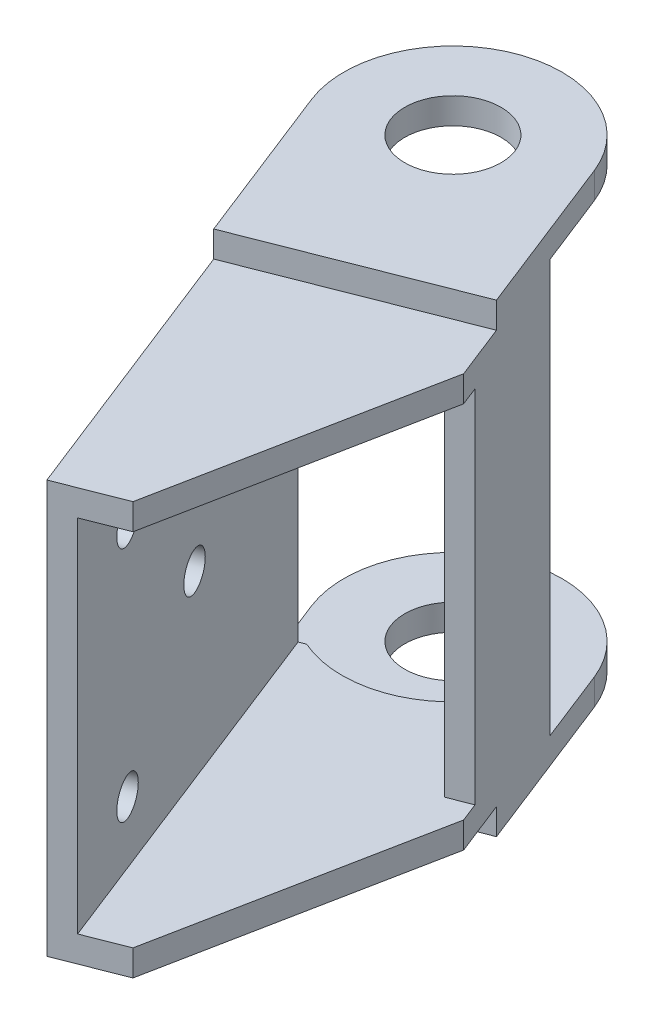
ISO-10303-21;
HEADER;
FILE_DESCRIPTION(('STEP AP214'),'2;1');
FILE_NAME('part.step','',(''),(''),'','','');
FILE_SCHEMA(('AUTOMOTIVE_DESIGN { 1 0 10303 214 1 1 1 1 }'));
ENDSEC;
DATA;
#1=APPLICATION_CONTEXT('core data for automotive mechanical design processes');
#2=APPLICATION_PROTOCOL_DEFINITION('international standard','automotive_design',2000,#1);
#3=PRODUCT_CONTEXT('',#1,'mechanical');
#4=PRODUCT('Part','Part','',(#3));
#5=PRODUCT_RELATED_PRODUCT_CATEGORY('part','',(#4));
#6=PRODUCT_DEFINITION_FORMATION('','',#4);
#7=PRODUCT_DEFINITION_CONTEXT('part definition',#1,'design');
#8=PRODUCT_DEFINITION('design','',#6,#7);
#9=PRODUCT_DEFINITION_SHAPE('','',#8);
#10=(LENGTH_UNIT() NAMED_UNIT(*) SI_UNIT(.MILLI.,.METRE.));
#11=(NAMED_UNIT(*) PLANE_ANGLE_UNIT() SI_UNIT($,.RADIAN.));
#12=(NAMED_UNIT(*) SI_UNIT($,.STERADIAN.) SOLID_ANGLE_UNIT());
#13=UNCERTAINTY_MEASURE_WITH_UNIT(LENGTH_MEASURE(1.E-05),#10,'distance_accuracy_value','');
#14=(GEOMETRIC_REPRESENTATION_CONTEXT(3) GLOBAL_UNCERTAINTY_ASSIGNED_CONTEXT((#13)) GLOBAL_UNIT_ASSIGNED_CONTEXT((#10,
#11,#12)) REPRESENTATION_CONTEXT('',''));
#15=CARTESIAN_POINT('',(0.,0.,0.));
#16=DIRECTION('',(0.,0.,1.));
#17=DIRECTION('',(1.,0.,0.));
#18=AXIS2_PLACEMENT_3D('',#15,#16,#17);
#19=CARTESIAN_POINT('',(-160.72838452882,-5.5,51.9386173243801));
#20=DIRECTION('',(0.,1.,0.));
#21=DIRECTION('',(0.,0.,1.));
#22=AXIS2_PLACEMENT_3D('',#19,#20,#21);
#23=PLANE('',#22);
#24=DIRECTION('',(0.365652358002226,0.,0.930751499105648));
#25=VECTOR('',#24,1.);
#26=CARTESIAN_POINT('',(-150.024742289129,-5.5,47.7336152073636));
#27=LINE('',#26,#25);
#28=CARTESIAN_POINT('',(-161.177139208116,-5.5,19.3456944848454));
#29=VERTEX_POINT('',#28);
#30=CARTESIAN_POINT('',(-154.503983674491,-5.5,36.3319093437392));
#31=VERTEX_POINT('',#30);
#32=EDGE_CURVE('E309',#29,#31,#27,.T.);
#33=ORIENTED_EDGE('',*,*,#32,.T.);
#34=DIRECTION('',(-0.930751499105649,0.,0.365652358002226));
#35=VECTOR('',#34,1.);
#36=CARTESIAN_POINT('',(-165.207625914183,-5.5,40.5369114607557));
#37=LINE('',#36,#35);
#38=CARTESIAN_POINT('',(-175.911268153856,-5.5,44.7419135777648));
#39=VERTEX_POINT('',#38);
#40=EDGE_CURVE('E55',#31,#39,#37,.T.);
#41=ORIENTED_EDGE('',*,*,#40,.T.);
#42=DIRECTION('',(-0.365652358000698,0.,-0.930751499106249));
#43=VECTOR('',#42,1.);
#44=CARTESIAN_POINT('',(-182.58442368746,-5.5,27.7556987188424));
#45=LINE('',#44,#43);
#46=CARTESIAN_POINT('',(-182.58442368746,-5.5,27.7556987188424));
#47=VERTEX_POINT('',#46);
#48=EDGE_CURVE('E304',#39,#47,#45,.T.);
#49=ORIENTED_EDGE('',*,*,#48,.T.);
#50=CARTESIAN_POINT('',(-171.880781447785,-5.5,23.5506966018527));
#51=DIRECTION('',(0.,-1.,0.));
#52=DIRECTION('',(0.,0.,1.));
#53=AXIS2_PLACEMENT_3D('',#50,#51,#52);
#54=CIRCLE('',#53,11.49999999995);
#55=EDGE_CURVE('E306',#47,#29,#54,.T.);
#56=ORIENTED_EDGE('',*,*,#55,.T.);
#57=EDGE_LOOP('',(#33,#41,#49,#56));
#58=FACE_BOUND('',#57,.T.);
#59=CARTESIAN_POINT('',(-171.8807814485,-5.5,23.5506966021));
#60=DIRECTION('',(0.,-1.,0.));
#61=DIRECTION('',(0.,0.,-1.));
#62=AXIS2_PLACEMENT_3D('',#59,#60,#61);
#63=CIRCLE('',#62,5.07500000000002);
#64=CARTESIAN_POINT('',(-171.8807814485,-5.5,18.4756966021));
#65=VERTEX_POINT('',#64);
#66=EDGE_CURVE('E266',#65,#65,#63,.T.);
#67=ORIENTED_EDGE('',*,*,#66,.F.);
#68=EDGE_LOOP('',(#67));
#69=FACE_BOUND('',#68,.T.);
#70=ADVANCED_FACE('F47',(#58,#69),#23,.F.);
#71=CARTESIAN_POINT('',(-11.9490681605092,0.,-30.4158112478024));
#72=DIRECTION('',(-0.365652358002225,0.,-0.930751499105649));
#73=DIRECTION('',(-0.930751499105649,0.,0.365652358002225));
#74=AXIS2_PLACEMENT_3D('',#71,#72,#73);
#75=PLANE('',#74);
#76=DIRECTION('',(0.,1.,0.));
#77=VECTOR('',#76,1.);
#78=CARTESIAN_POINT('',(-176.585881805809,-2.75,34.2629340254768));
#79=LINE('',#78,#77);
#80=CARTESIAN_POINT('',(-176.585881805809,-2.75,34.2629340254768));
#81=VERTEX_POINT('',#80);
#82=CARTESIAN_POINT('',(-176.585881805809,0.,34.2629340254768));
#83=VERTEX_POINT('',#82);
#84=EDGE_CURVE('E299',#81,#83,#79,.T.);
#85=ORIENTED_EDGE('',*,*,#84,.F.);
#86=DIRECTION('',(-0.930751499105649,0.,0.365652358002225));
#87=VECTOR('',#86,1.);
#88=CARTESIAN_POINT('',(-158.160507254501,-2.75,27.0243943527135));
#89=LINE('',#88,#87);
#90=CARTESIAN_POINT('',(-179.567791733931,-2.75,35.4343985867648));
#91=VERTEX_POINT('',#90);
#92=EDGE_CURVE('E369',#81,#91,#89,.T.);
#93=ORIENTED_EDGE('',*,*,#92,.T.);
#94=DIRECTION('',(0.,1.,0.));
#95=VECTOR('',#94,1.);
#96=CARTESIAN_POINT('',(-179.567791733931,-2.75,35.4343985867648));
#97=LINE('',#96,#95);
#98=CARTESIAN_POINT('',(-179.567791733931,40.75,35.4343985867648));
#99=VERTEX_POINT('',#98);
#100=EDGE_CURVE('E375',#91,#99,#97,.T.);
#101=ORIENTED_EDGE('',*,*,#100,.T.);
#102=DIRECTION('',(0.930751499105649,0.,-0.365652358002225));
#103=VECTOR('',#102,1.);
#104=CARTESIAN_POINT('',(-179.567791733931,40.75,35.4343985867648));
#105=LINE('',#104,#103);
#106=CARTESIAN_POINT('',(-176.585881805809,40.75,34.2629340254766));
#107=VERTEX_POINT('',#106);
#108=EDGE_CURVE('E379',#99,#107,#105,.T.);
#109=ORIENTED_EDGE('',*,*,#108,.T.);
#110=DIRECTION('',(0.,1.,0.));
#111=VECTOR('',#110,1.);
#112=CARTESIAN_POINT('',(-176.585881805809,38.,34.2629340254768));
#113=LINE('',#112,#111);
#114=CARTESIAN_POINT('',(-176.585881805809,38.0000000000003,34.2629340254769));
#115=VERTEX_POINT('',#114);
#116=EDGE_CURVE('E366',#115,#107,#113,.T.);
#117=ORIENTED_EDGE('',*,*,#116,.F.);
#118=DIRECTION('',(0.930751499105649,0.,-0.365652358002225));
#119=VECTOR('',#118,1.);
#120=CARTESIAN_POINT('',(-177.240912986167,38.0000000000003,34.5202676917593));
#121=LINE('',#120,#119);
#122=CARTESIAN_POINT('',(-177.240912986167,38.0000000000003,34.5202676917593));
#123=VERTEX_POINT('',#122);
#124=EDGE_CURVE('E340',#123,#115,#121,.T.);
#125=ORIENTED_EDGE('',*,*,#124,.F.);
#126=DIRECTION('',(0.,1.,0.));
#127=VECTOR('',#126,1.);
#128=CARTESIAN_POINT('',(-177.240912986166,2.74925928360182E-13,34.5202676917592));
#129=LINE('',#128,#127);
#130=CARTESIAN_POINT('',(-177.240912986166,2.74925928360182E-13,34.5202676917592));
#131=VERTEX_POINT('',#130);
#132=EDGE_CURVE('E337',#131,#123,#129,.T.);
#133=ORIENTED_EDGE('',*,*,#132,.F.);
#134=DIRECTION('',(0.930751499105649,0.,-0.365652358002226));
#135=VECTOR('',#134,1.);
#136=CARTESIAN_POINT('',(-176.585881805809,0.,34.2629340254767));
#137=LINE('',#136,#135);
#138=EDGE_CURVE('E357',#131,#83,#137,.T.);
#139=ORIENTED_EDGE('',*,*,#138,.T.);
#140=EDGE_LOOP('',(#85,#93,#101,#109,#117,#125,#133,#139));
#141=FACE_BOUND('',#140,.T.);
#142=ADVANCED_FACE('F444',(#141),#75,.T.);
#143=CARTESIAN_POINT('',(-6.82993515371631,0.,-17.3852902704244));
#144=DIRECTION('',(0.365652358061123,0.,0.93075149908251));
#145=DIRECTION('',(0.93075149908251,0.,-0.365652358061123));
#146=AXIS2_PLACEMENT_3D('',#143,#144,#145);
#147=PLANE('',#146);
#148=DIRECTION('',(-0.93075149908251,0.,0.365652358061123));
#149=VECTOR('',#148,1.);
#150=CARTESIAN_POINT('',(-153.041374243652,38.,40.0549153391781));
#151=LINE('',#150,#149);
#152=CARTESIAN_POINT('',(-153.041374243652,38.,40.0549153391781));
#153=VERTEX_POINT('',#152);
#154=CARTESIAN_POINT('',(-155.368252990242,38.0000000000002,40.9690462351789));
#155=VERTEX_POINT('',#154);
#156=EDGE_CURVE('E345',#153,#155,#151,.T.);
#157=ORIENTED_EDGE('',*,*,#156,.T.);
#158=DIRECTION('',(0.,1.,0.));
#159=VECTOR('',#158,1.);
#160=CARTESIAN_POINT('',(-155.368252990242,2.51062781034005E-13,40.9690462351788));
#161=LINE('',#160,#159);
#162=CARTESIAN_POINT('',(-155.36825299068,0.,40.9690462340644));
#163=VERTEX_POINT('',#162);
#164=EDGE_CURVE('E331',#163,#155,#161,.T.);
#165=ORIENTED_EDGE('',*,*,#164,.F.);
#166=DIRECTION('',(0.93075149908251,0.,-0.365652358061123));
#167=VECTOR('',#166,1.);
#168=CARTESIAN_POINT('',(-156.023284171507,0.,41.2263799005793));
#169=LINE('',#168,#167);
#170=CARTESIAN_POINT('',(-153.041374243652,0.,40.0549153391781));
#171=VERTEX_POINT('',#170);
#172=EDGE_CURVE('E348',#163,#171,#169,.T.);
#173=ORIENTED_EDGE('',*,*,#172,.T.);
#174=DIRECTION('',(0.,1.,0.));
#175=VECTOR('',#174,1.);
#176=CARTESIAN_POINT('',(-153.041374243652,0.,40.0549153391781));
#177=LINE('',#176,#175);
#178=EDGE_CURVE('E342',#171,#153,#177,.T.);
#179=ORIENTED_EDGE('',*,*,#178,.T.);
#180=EDGE_LOOP('',(#157,#165,#173,#179));
#181=FACE_BOUND('',#180,.T.);
#182=ADVANCED_FACE('F474',(#181),#147,.T.);
#183=DIRECTION('',(0.,1.,0.));
#184=VECTOR('',#183,1.);
#185=CARTESIAN_POINT('',(-161.142417182623,-2.75,28.1958589140017));
#186=LINE('',#185,#184);
#187=CARTESIAN_POINT('',(-161.142417182623,-2.75,28.1958589140016));
#188=VERTEX_POINT('',#187);
#189=CARTESIAN_POINT('',(-161.142417182623,0.,28.1958589140017));
#190=VERTEX_POINT('',#189);
#191=EDGE_CURVE('E297',#188,#190,#186,.T.);
#192=ORIENTED_EDGE('',*,*,#191,.T.);
#193=CARTESIAN_POINT('',(-160.487386002265,2.51062781034004E-13,27.9385252477194));
#194=VERTEX_POINT('',#193);
#195=EDGE_CURVE('E354',#190,#194,#137,.T.);
#196=ORIENTED_EDGE('',*,*,#195,.T.);
#197=DIRECTION('',(0.,-1.,0.));
#198=VECTOR('',#197,1.);
#199=CARTESIAN_POINT('',(-160.487386002265,38.0000000000002,27.9385252477194));
#200=LINE('',#199,#198);
#201=CARTESIAN_POINT('',(-160.487386002265,38.0000000000002,27.9385252477194));
#202=VERTEX_POINT('',#201);
#203=EDGE_CURVE('E326',#202,#194,#200,.T.);
#204=ORIENTED_EDGE('',*,*,#203,.F.);
#205=DIRECTION('',(-0.930751499105649,0.,0.365652358002225));
#206=VECTOR('',#205,1.);
#207=CARTESIAN_POINT('',(-160.487386002265,38.0000000000002,27.9385252477194));
#208=LINE('',#207,#206);
#209=CARTESIAN_POINT('',(-161.142417182623,38.0000000000002,28.1958589140019));
#210=VERTEX_POINT('',#209);
#211=EDGE_CURVE('E334',#202,#210,#208,.T.);
#212=ORIENTED_EDGE('',*,*,#211,.T.);
#213=DIRECTION('',(0.,1.,0.));
#214=VECTOR('',#213,1.);
#215=CARTESIAN_POINT('',(-161.142417182623,38.,28.1958589140015));
#216=LINE('',#215,#214);
#217=CARTESIAN_POINT('',(-161.142417182623,40.75,28.1958589140015));
#218=VERTEX_POINT('',#217);
#219=EDGE_CURVE('E364',#210,#218,#216,.T.);
#220=ORIENTED_EDGE('',*,*,#219,.T.);
#221=CARTESIAN_POINT('',(-158.160507254501,40.75,27.0243943527135));
#222=VERTEX_POINT('',#221);
#223=EDGE_CURVE('E378',#218,#222,#105,.T.);
#224=ORIENTED_EDGE('',*,*,#223,.T.);
#225=DIRECTION('',(0.,-1.,0.));
#226=VECTOR('',#225,1.);
#227=CARTESIAN_POINT('',(-158.160507254501,40.75,27.0243943527135));
#228=LINE('',#227,#226);
#229=CARTESIAN_POINT('',(-158.160507254501,-2.75,27.0243943527136));
#230=VERTEX_POINT('',#229);
#231=EDGE_CURVE('E382',#222,#230,#228,.T.);
#232=ORIENTED_EDGE('',*,*,#231,.T.);
#233=EDGE_CURVE('E372',#230,#188,#89,.T.);
#234=ORIENTED_EDGE('',*,*,#233,.T.);
#235=EDGE_LOOP('',(#192,#196,#204,#212,#220,#224,#232,#234));
#236=FACE_BOUND('',#235,.T.);
#237=ADVANCED_FACE('F454',(#236),#75,.T.);
#238=CARTESIAN_POINT('',(-164.933386645826,38.,41.234975084785));
#239=DIRECTION('',(0.,1.,0.));
#240=DIRECTION('',(1.,0.,0.));
#241=AXIS2_PLACEMENT_3D('',#238,#239,#240);
#242=PLANE('',#241);
#243=DIRECTION('',(-0.930751499105649,0.,0.365652358002225));
#244=VECTOR('',#243,1.);
#245=CARTESIAN_POINT('',(-164.530338511181,38.,73.7115539872527));
#246=LINE('',#245,#244);
#247=CARTESIAN_POINT('',(-158.015078017441,38.,71.1519874812371));
#248=VERTEX_POINT('',#247);
#249=CARTESIAN_POINT('',(-162.203459763416,38.,72.797423092247));
#250=VERTEX_POINT('',#249);
#251=EDGE_CURVE('E218',#248,#250,#246,.T.);
#252=ORIENTED_EDGE('',*,*,#251,.T.);
#253=DIRECTION('',(0.365652358002226,0.,0.930751499105649));
#254=VECTOR('',#253,1.);
#255=CARTESIAN_POINT('',(-177.240912986167,38.0000000000003,34.5202676917593));
#256=LINE('',#255,#254);
#257=EDGE_CURVE('E70',#123,#250,#256,.T.);
#258=ORIENTED_EDGE('',*,*,#257,.F.);
#259=ORIENTED_EDGE('',*,*,#124,.T.);
#260=CARTESIAN_POINT('',(-171.880781447868,38.,23.5506966017777));
#261=DIRECTION('',(0.,1.,0.));
#262=DIRECTION('',(0.,0.,1.));
#263=AXIS2_PLACEMENT_3D('',#260,#261,#262);
#264=CIRCLE('',#263,11.6999999999998);
#265=EDGE_CURVE('E361',#115,#210,#264,.T.);
#266=ORIENTED_EDGE('',*,*,#265,.T.);
#267=ORIENTED_EDGE('',*,*,#211,.F.);
#268=DIRECTION('',(-0.365652358002224,0.,-0.930751499105649));
#269=VECTOR('',#268,1.);
#270=CARTESIAN_POINT('',(-155.368252990242,38.0000000000002,40.9690462351789));
#271=LINE('',#270,#269);
#272=EDGE_CURVE('E323',#155,#202,#271,.T.);
#273=ORIENTED_EDGE('',*,*,#272,.F.);
#274=ORIENTED_EDGE('',*,*,#156,.F.);
#275=DIRECTION('',(0.365652358061124,0.,0.93075149908251));
#276=VECTOR('',#275,1.);
#277=CARTESIAN_POINT('',(-153.041374243652,38.,40.0549153391781));
#278=LINE('',#277,#276);
#279=CARTESIAN_POINT('',(-152.264362981806,38.,42.0327622755602));
#280=VERTEX_POINT('',#279);
#281=EDGE_CURVE('E350',#153,#280,#278,.T.);
#282=ORIENTED_EDGE('',*,*,#281,.T.);
#283=DIRECTION('',(-0.193746512314773,0.,0.981051624006536));
#284=VECTOR('',#283,1.);
#285=CARTESIAN_POINT('',(-158.015078017441,38.,71.1519874812371));
#286=LINE('',#285,#284);
#287=EDGE_CURVE('E240',#280,#248,#286,.T.);
#288=ORIENTED_EDGE('',*,*,#287,.T.);
#289=EDGE_LOOP('',(#252,#258,#259,#266,#267,#273,#274,#282,#288));
#290=FACE_BOUND('',#289,.T.);
#291=ADVANCED_FACE('F448',(#290),#242,.F.);
#292=CARTESIAN_POINT('',(-177.008225228049,-5.5,41.9496590801645));
#293=DIRECTION('',(-0.930751499105649,0.,0.365652358002226));
#294=DIRECTION('',(0.,1.,0.));
#295=AXIS2_PLACEMENT_3D('',#292,#293,#294);
#296=PLANE('',#295);
#297=CARTESIAN_POINT('',(-167.935476095037,6.5,65.0439306519319));
#298=DIRECTION('',(-0.930751499105649,0.,0.365652358002226));
#299=DIRECTION('',(0.365652358002226,0.,0.930751499105649));
#300=AXIS2_PLACEMENT_3D('',#297,#298,#299);
#301=CIRCLE('',#300,2.00000000000001);
#302=CARTESIAN_POINT('',(-167.204171379032,6.5,66.9054336501432));
#303=VERTEX_POINT('',#302);
#304=EDGE_CURVE('E860',#303,#303,#301,.T.);
#305=ORIENTED_EDGE('',*,*,#304,.F.);
#306=EDGE_LOOP('',(#305));
#307=FACE_BOUND('',#306,.T.);
#308=CARTESIAN_POINT('',(-167.935476095037,31.5,65.0439306519319));
#309=DIRECTION('',(-0.930751499105649,0.,0.365652358002226));
#310=DIRECTION('',(0.365652358002226,0.,0.930751499105649));
#311=AXIS2_PLACEMENT_3D('',#308,#309,#310);
#312=CIRCLE('',#311,2.00000000000001);
#313=CARTESIAN_POINT('',(-167.204171379032,31.5,66.9054336501432));
#314=VERTEX_POINT('',#313);
#315=EDGE_CURVE('E864',#314,#314,#312,.T.);
#316=ORIENTED_EDGE('',*,*,#315,.F.);
#317=EDGE_LOOP('',(#316));
#318=FACE_BOUND('',#317,.T.);
#319=CARTESIAN_POINT('',(-172.506130570065,19.,53.4095369131112));
#320=DIRECTION('',(-0.930751499105649,0.,0.365652358002226));
#321=DIRECTION('',(0.365652358002226,0.,0.930751499105649));
#322=AXIS2_PLACEMENT_3D('',#319,#320,#321);
#323=CIRCLE('',#322,2.00000000000001);
#324=CARTESIAN_POINT('',(-171.77482585406,19.,55.2710399113225));
#325=VERTEX_POINT('',#324);
#326=EDGE_CURVE('E867',#325,#325,#323,.T.);
#327=ORIENTED_EDGE('',*,*,#326,.F.);
#328=EDGE_LOOP('',(#327));
#329=FACE_BOUND('',#328,.T.);
#330=DIRECTION('',(0.,-1.,0.));
#331=VECTOR('',#330,1.);
#332=CARTESIAN_POINT('',(-164.530338511181,38.2337242901608,73.7115539872527));
#333=LINE('',#332,#331);
#334=CARTESIAN_POINT('',(-164.530338511181,40.75,73.7115539872527));
#335=VERTEX_POINT('',#334);
#336=CARTESIAN_POINT('',(-164.530338511181,-2.75,73.7115539872527));
#337=VERTEX_POINT('',#336);
#338=EDGE_CURVE('E250',#335,#337,#333,.T.);
#339=ORIENTED_EDGE('',*,*,#338,.F.);
#340=DIRECTION('',(0.365652358002226,0.,0.930751499105649));
#341=VECTOR('',#340,1.);
#342=CARTESIAN_POINT('',(-177.008225228049,40.75,41.9496590801645));
#343=LINE('',#342,#341);
#344=CARTESIAN_POINT('',(-175.911268153921,40.75,44.7419135777904));
#345=VERTEX_POINT('',#344);
#346=EDGE_CURVE('E233',#345,#335,#343,.T.);
#347=ORIENTED_EDGE('',*,*,#346,.F.);
#348=DIRECTION('',(0.,-1.,0.));
#349=VECTOR('',#348,1.);
#350=CARTESIAN_POINT('',(-175.911268153921,-5.5,44.7419135777904));
#351=LINE('',#350,#349);
#352=CARTESIAN_POINT('',(-175.911268153884,43.5,44.7419135777757));
#353=VERTEX_POINT('',#352);
#354=EDGE_CURVE('E279',#353,#345,#351,.T.);
#355=ORIENTED_EDGE('',*,*,#354,.F.);
#356=DIRECTION('',(0.365652357999172,0.,0.930751499106848));
#357=VECTOR('',#356,1.);
#358=CARTESIAN_POINT('',(-171.432026768565,43.5,56.1436194413973));
#359=LINE('',#358,#357);
#360=CARTESIAN_POINT('',(-182.584423687474,43.5,27.7556987188073));
#361=VERTEX_POINT('',#360);
#362=EDGE_CURVE('E394',#361,#353,#359,.T.);
#363=ORIENTED_EDGE('',*,*,#362,.F.);
#364=DIRECTION('',(0.,-1.,0.));
#365=VECTOR('',#364,1.);
#366=CARTESIAN_POINT('',(-182.584423687474,43.5,27.7556987188073));
#367=LINE('',#366,#365);
#368=CARTESIAN_POINT('',(-182.584423687583,40.75,27.7556987188033));
#369=VERTEX_POINT('',#368);
#370=EDGE_CURVE('E397',#361,#369,#367,.T.);
#371=ORIENTED_EDGE('',*,*,#370,.T.);
#372=DIRECTION('',(-0.365652358002225,0.,-0.930751499105649));
#373=VECTOR('',#372,1.);
#374=CARTESIAN_POINT('',(-179.567791733931,40.75,35.4343985867648));
#375=LINE('',#374,#373);
#376=EDGE_CURVE('E385',#99,#369,#375,.T.);
#377=ORIENTED_EDGE('',*,*,#376,.F.);
#378=ORIENTED_EDGE('',*,*,#100,.F.);
#379=DIRECTION('',(-0.365652358000698,0.,-0.930751499106249));
#380=VECTOR('',#379,1.);
#381=CARTESIAN_POINT('',(-182.58442368746,-2.75,27.7556987188424));
#382=LINE('',#381,#380);
#383=CARTESIAN_POINT('',(-182.58442368746,-2.75,27.7556987188424));
#384=VERTEX_POINT('',#383);
#385=EDGE_CURVE('E301',#91,#384,#382,.T.);
#386=ORIENTED_EDGE('',*,*,#385,.T.);
#387=DIRECTION('',(0.,1.,0.));
#388=VECTOR('',#387,1.);
#389=CARTESIAN_POINT('',(-182.58442368746,-5.5,27.7556987188424));
#390=LINE('',#389,#388);
#391=EDGE_CURVE('E320',#47,#384,#390,.T.);
#392=ORIENTED_EDGE('',*,*,#391,.F.);
#393=ORIENTED_EDGE('',*,*,#48,.F.);
#394=DIRECTION('',(0.,-1.,0.));
#395=VECTOR('',#394,1.);
#396=CARTESIAN_POINT('',(-175.911268153921,-5.50000000000002,44.7419135777904));
#397=LINE('',#396,#395);
#398=CARTESIAN_POINT('',(-175.911268153921,-2.75,44.7419135777904));
#399=VERTEX_POINT('',#398);
#400=EDGE_CURVE('E290',#399,#39,#397,.T.);
#401=ORIENTED_EDGE('',*,*,#400,.F.);
#402=DIRECTION('',(-0.365652358002226,0.,-0.930751499105649));
#403=VECTOR('',#402,1.);
#404=CARTESIAN_POINT('',(-177.008225228049,-2.75,41.9496590801645));
#405=LINE('',#404,#403);
#406=EDGE_CURVE('E292',#337,#399,#405,.T.);
#407=ORIENTED_EDGE('',*,*,#406,.F.);
#408=EDGE_LOOP('',(#339,#347,#355,#363,#371,#377,#378,#386,#392,#393,#401,#407));
#409=FACE_BOUND('',#408,.T.);
#410=ADVANCED_FACE('F49',(#307,#318,#329,#409),#296,.T.);
#411=CARTESIAN_POINT('',(-155.600940748619,-5.5,33.5396548461134));
#412=DIRECTION('',(0.930751499105649,0.,-0.365652358002226));
#413=DIRECTION('',(0.,-1.,0.));
#414=AXIS2_PLACEMENT_3D('',#411,#412,#413);
#415=PLANE('',#414);
#416=DIRECTION('',(0.,-1.,0.));
#417=VECTOR('',#416,1.);
#418=CARTESIAN_POINT('',(-152.264362981806,82.9361499625184,42.0327622755602));
#419=LINE('',#418,#417);
#420=CARTESIAN_POINT('',(-152.264362981806,0.,42.0327622755602));
#421=VERTEX_POINT('',#420);
#422=CARTESIAN_POINT('',(-152.264362981806,-2.75,42.0327622755602));
#423=VERTEX_POINT('',#422);
#424=EDGE_CURVE('E257',#421,#423,#419,.T.);
#425=ORIENTED_EDGE('',*,*,#424,.T.);
#426=DIRECTION('',(0.365652358002225,0.,0.930751499105649));
#427=VECTOR('',#426,1.);
#428=CARTESIAN_POINT('',(-154.503983674491,-2.75,36.3319093437392));
#429=LINE('',#428,#427);
#430=CARTESIAN_POINT('',(-154.503983674491,-2.75,36.3319093437392));
#431=VERTEX_POINT('',#430);
#432=EDGE_CURVE('E285',#431,#423,#429,.T.);
#433=ORIENTED_EDGE('',*,*,#432,.F.);
#434=DIRECTION('',(0.,1.,0.));
#435=VECTOR('',#434,1.);
#436=CARTESIAN_POINT('',(-154.503983674491,-5.5,36.3319093437392));
#437=LINE('',#436,#435);
#438=EDGE_CURVE('E282',#31,#431,#437,.T.);
#439=ORIENTED_EDGE('',*,*,#438,.F.);
#440=ORIENTED_EDGE('',*,*,#32,.F.);
#441=DIRECTION('',(0.,1.,0.));
#442=VECTOR('',#441,1.);
#443=CARTESIAN_POINT('',(-161.177139208116,-5.5,19.3456944848454));
#444=LINE('',#443,#442);
#445=CARTESIAN_POINT('',(-161.177139208116,-2.75,19.3456944848454));
#446=VERTEX_POINT('',#445);
#447=EDGE_CURVE('E312',#29,#446,#444,.T.);
#448=ORIENTED_EDGE('',*,*,#447,.T.);
#449=DIRECTION('',(0.365652358002226,0.,0.930751499105648));
#450=VECTOR('',#449,1.);
#451=CARTESIAN_POINT('',(-150.024742289129,-2.75,47.7336152073636));
#452=LINE('',#451,#450);
#453=EDGE_CURVE('E307',#446,#230,#452,.T.);
#454=ORIENTED_EDGE('',*,*,#453,.T.);
#455=ORIENTED_EDGE('',*,*,#231,.F.);
#456=DIRECTION('',(-0.365652358002225,0.,-0.930751499105649));
#457=VECTOR('',#456,1.);
#458=CARTESIAN_POINT('',(-158.160507254501,40.75,27.0243943527135));
#459=LINE('',#458,#457);
#460=CARTESIAN_POINT('',(-161.177139208153,40.75,19.3456944847521));
#461=VERTEX_POINT('',#460);
#462=EDGE_CURVE('E386',#222,#461,#459,.T.);
#463=ORIENTED_EDGE('',*,*,#462,.T.);
#464=DIRECTION('',(0.,-1.,0.));
#465=VECTOR('',#464,1.);
#466=CARTESIAN_POINT('',(-161.177139208116,43.5,19.3456944848454));
#467=LINE('',#466,#465);
#468=CARTESIAN_POINT('',(-161.177139208116,43.5,19.3456944848454));
#469=VERTEX_POINT('',#468);
#470=EDGE_CURVE('E402',#469,#461,#467,.T.);
#471=ORIENTED_EDGE('',*,*,#470,.F.);
#472=DIRECTION('',(-0.3656523580007,0.,-0.930751499106248));
#473=VECTOR('',#472,1.);
#474=CARTESIAN_POINT('',(-161.177139208116,43.5,19.3456944848454));
#475=LINE('',#474,#473);
#476=CARTESIAN_POINT('',(-154.503983674519,43.5,36.3319093437501));
#477=VERTEX_POINT('',#476);
#478=EDGE_CURVE('E390',#477,#469,#475,.T.);
#479=ORIENTED_EDGE('',*,*,#478,.F.);
#480=DIRECTION('',(0.,1.,0.));
#481=VECTOR('',#480,1.);
#482=CARTESIAN_POINT('',(-154.503983674491,40.75,36.3319093437392));
#483=LINE('',#482,#481);
#484=CARTESIAN_POINT('',(-154.503983674491,40.75,36.3319093437392));
#485=VERTEX_POINT('',#484);
#486=EDGE_CURVE('E274',#485,#477,#483,.T.);
#487=ORIENTED_EDGE('',*,*,#486,.F.);
#488=DIRECTION('',(-0.365652358002225,0.,-0.930751499105649));
#489=VECTOR('',#488,1.);
#490=CARTESIAN_POINT('',(-150.024742289085,40.75,47.7336152074748));
#491=LINE('',#490,#489);
#492=CARTESIAN_POINT('',(-152.264362981806,40.75,42.0327622755602));
#493=VERTEX_POINT('',#492);
#494=EDGE_CURVE('E272',#493,#485,#491,.T.);
#495=ORIENTED_EDGE('',*,*,#494,.F.);
#496=EDGE_CURVE('E225',#493,#280,#419,.T.);
#497=ORIENTED_EDGE('',*,*,#496,.T.);
#498=ORIENTED_EDGE('',*,*,#281,.F.);
#499=ORIENTED_EDGE('',*,*,#178,.F.);
#500=DIRECTION('',(0.365652358061124,0.,0.93075149908251));
#501=VECTOR('',#500,1.);
#502=CARTESIAN_POINT('',(-153.041374243652,0.,40.0549153391781));
#503=LINE('',#502,#501);
#504=EDGE_CURVE('E351',#171,#421,#503,.T.);
#505=ORIENTED_EDGE('',*,*,#504,.T.);
#506=EDGE_LOOP('',(#425,#433,#439,#440,#448,#454,#455,#463,#471,#479,#487,#495,#497,#498,#499,#505));
#507=FACE_BOUND('',#506,.T.);
#508=ADVANCED_FACE('F423',(#507),#415,.T.);
#509=CARTESIAN_POINT('',(-160.72838452886,40.75,51.938617324416));
#510=DIRECTION('',(0.,-1.,0.));
#511=DIRECTION('',(0.,0.,-1.));
#512=AXIS2_PLACEMENT_3D('',#509,#510,#511);
#513=PLANE('',#512);
#514=CARTESIAN_POINT('',(-171.8807814485,40.75,23.5506966021));
#515=DIRECTION('',(0.,-1.,0.));
#516=DIRECTION('',(0.,0.,-1.));
#517=AXIS2_PLACEMENT_3D('',#514,#515,#516);
#518=CIRCLE('',#517,5.07500000000002);
#519=CARTESIAN_POINT('',(-171.8807814485,40.75,18.4756966021));
#520=VERTEX_POINT('',#519);
#521=EDGE_CURVE('E260',#520,#520,#518,.T.);
#522=ORIENTED_EDGE('',*,*,#521,.F.);
#523=EDGE_LOOP('',(#522));
#524=FACE_BOUND('',#523,.T.);
#525=CARTESIAN_POINT('',(-171.880781447792,40.75,23.5506966018351));
#526=DIRECTION('',(0.,1.,0.));
#527=DIRECTION('',(0.,0.,-1.));
#528=AXIS2_PLACEMENT_3D('',#525,#526,#527);
#529=CIRCLE('',#528,11.49999999995);
#530=EDGE_CURVE('E388',#461,#369,#529,.T.);
#531=ORIENTED_EDGE('',*,*,#530,.F.);
#532=ORIENTED_EDGE('',*,*,#462,.F.);
#533=ORIENTED_EDGE('',*,*,#223,.F.);
#534=CARTESIAN_POINT('',(-171.880781447868,40.75,23.5506966017777));
#535=DIRECTION('',(0.,1.,0.));
#536=DIRECTION('',(0.,0.,1.));
#537=AXIS2_PLACEMENT_3D('',#534,#535,#536);
#538=CIRCLE('',#537,11.6999999999998);
#539=EDGE_CURVE('E360',#107,#218,#538,.T.);
#540=ORIENTED_EDGE('',*,*,#539,.F.);
#541=ORIENTED_EDGE('',*,*,#108,.F.);
#542=ORIENTED_EDGE('',*,*,#376,.T.);
#543=EDGE_LOOP('',(#531,#532,#533,#540,#541,#542));
#544=FACE_BOUND('',#543,.T.);
#545=ADVANCED_FACE('F459',(#524,#544),#513,.T.);
#546=CARTESIAN_POINT('',(-171.880781447792,43.5,23.5506966018351));
#547=DIRECTION('',(0.,-1.,0.));
#548=DIRECTION('',(0.,0.,-1.));
#549=AXIS2_PLACEMENT_3D('',#546,#547,#548);
#550=CYLINDRICAL_SURFACE('',#549,11.49999999995);
#551=ORIENTED_EDGE('',*,*,#530,.T.);
#552=ORIENTED_EDGE('',*,*,#370,.F.);
#553=CARTESIAN_POINT('',(-171.880781447792,43.5,23.5506966018351));
#554=DIRECTION('',(0.,1.,0.));
#555=DIRECTION('',(0.,0.,-1.));
#556=AXIS2_PLACEMENT_3D('',#553,#554,#555);
#557=CIRCLE('',#556,11.49999999995);
#558=EDGE_CURVE('E392',#469,#361,#557,.T.);
#559=ORIENTED_EDGE('',*,*,#558,.F.);
#560=ORIENTED_EDGE('',*,*,#470,.T.);
#561=EDGE_LOOP('',(#551,#552,#559,#560));
#562=FACE_BOUND('',#561,.T.);
#563=ADVANCED_FACE('F486',(#562),#550,.T.);
#564=CARTESIAN_POINT('',(-160.72838452886,43.5,51.938617324416));
#565=DIRECTION('',(0.,-1.,0.));
#566=DIRECTION('',(0.,0.,-1.));
#567=AXIS2_PLACEMENT_3D('',#564,#565,#566);
#568=PLANE('',#567);
#569=CARTESIAN_POINT('',(-171.8807814485,43.5,23.5506966021));
#570=DIRECTION('',(0.,-1.,0.));
#571=DIRECTION('',(0.,0.,-1.));
#572=AXIS2_PLACEMENT_3D('',#569,#570,#571);
#573=CIRCLE('',#572,5.07500000000002);
#574=CARTESIAN_POINT('',(-171.8807814485,43.5,18.4756966021));
#575=VERTEX_POINT('',#574);
#576=EDGE_CURVE('E263',#575,#575,#573,.T.);
#577=ORIENTED_EDGE('',*,*,#576,.T.);
#578=EDGE_LOOP('',(#577));
#579=FACE_BOUND('',#578,.T.);
#580=ORIENTED_EDGE('',*,*,#362,.T.);
#581=DIRECTION('',(0.930751499105649,0.,-0.365652358002226));
#582=VECTOR('',#581,1.);
#583=CARTESIAN_POINT('',(-165.207625914229,43.5,40.5369114607739));
#584=LINE('',#583,#582);
#585=EDGE_CURVE('E12',#353,#477,#584,.T.);
#586=ORIENTED_EDGE('',*,*,#585,.T.);
#587=ORIENTED_EDGE('',*,*,#478,.T.);
#588=ORIENTED_EDGE('',*,*,#558,.T.);
#589=EDGE_LOOP('',(#580,#586,#587,#588));
#590=FACE_BOUND('',#589,.T.);
#591=ADVANCED_FACE('F482',(#579,#590),#568,.F.);
#592=CARTESIAN_POINT('',(-160.72838452886,0.,51.938617324416));
#593=DIRECTION('',(0.,1.,0.));
#594=DIRECTION('',(0.,0.,1.));
#595=AXIS2_PLACEMENT_3D('',#592,#593,#594);
#596=PLANE('',#595);
#597=DIRECTION('',(-0.365652358002224,0.,-0.930751499105649));
#598=VECTOR('',#597,1.);
#599=CARTESIAN_POINT('',(-172.121779974143,2.74925928360181E-13,47.550788679219));
#600=LINE('',#599,#598);
#601=CARTESIAN_POINT('',(-162.203459763416,0.,72.7974230922469));
#602=VERTEX_POINT('',#601);
#603=EDGE_CURVE('E62',#602,#131,#600,.T.);
#604=ORIENTED_EDGE('',*,*,#603,.F.);
#605=DIRECTION('',(-0.930751499105649,0.,0.365652358002225));
#606=VECTOR('',#605,1.);
#607=CARTESIAN_POINT('',(-164.530338511181,0.,73.7115539872527));
#608=LINE('',#607,#606);
#609=CARTESIAN_POINT('',(-158.015078017441,0.,71.1519874812371));
#610=VERTEX_POINT('',#609);
#611=EDGE_CURVE('E246',#610,#602,#608,.T.);
#612=ORIENTED_EDGE('',*,*,#611,.F.);
#613=DIRECTION('',(-0.193746512314773,0.,0.981051624006536));
#614=VECTOR('',#613,1.);
#615=CARTESIAN_POINT('',(-158.015078017441,0.,71.1519874812371));
#616=LINE('',#615,#614);
#617=EDGE_CURVE('E251',#421,#610,#616,.T.);
#618=ORIENTED_EDGE('',*,*,#617,.F.);
#619=ORIENTED_EDGE('',*,*,#504,.F.);
#620=ORIENTED_EDGE('',*,*,#172,.F.);
#621=DIRECTION('',(0.365652358002224,0.,0.930751499105649));
#622=VECTOR('',#621,1.);
#623=CARTESIAN_POINT('',(-160.487386002265,2.51062781034004E-13,27.9385252477194));
#624=LINE('',#623,#622);
#625=EDGE_CURVE('E329',#194,#163,#624,.T.);
#626=ORIENTED_EDGE('',*,*,#625,.F.);
#627=ORIENTED_EDGE('',*,*,#195,.F.);
#628=CARTESIAN_POINT('',(-171.880781447868,0.,23.5506966017777));
#629=DIRECTION('',(0.,1.,0.));
#630=DIRECTION('',(0.,0.,1.));
#631=AXIS2_PLACEMENT_3D('',#628,#629,#630);
#632=CIRCLE('',#631,11.6999999999999);
#633=EDGE_CURVE('E294',#83,#190,#632,.T.);
#634=ORIENTED_EDGE('',*,*,#633,.F.);
#635=ORIENTED_EDGE('',*,*,#138,.F.);
#636=EDGE_LOOP('',(#604,#612,#618,#619,#620,#626,#627,#634,#635));
#637=FACE_BOUND('',#636,.T.);
#638=ADVANCED_FACE('F437',(#637),#596,.T.);
#639=CARTESIAN_POINT('',(-171.880781447868,38.,23.5506966017777));
#640=DIRECTION('',(0.,1.,0.));
#641=DIRECTION('',(0.,0.,1.));
#642=AXIS2_PLACEMENT_3D('',#639,#640,#641);
#643=CYLINDRICAL_SURFACE('',#642,11.6999999999998);
#644=ORIENTED_EDGE('',*,*,#539,.T.);
#645=ORIENTED_EDGE('',*,*,#219,.F.);
#646=ORIENTED_EDGE('',*,*,#265,.F.);
#647=ORIENTED_EDGE('',*,*,#116,.T.);
#648=EDGE_LOOP('',(#644,#645,#646,#647));
#649=FACE_BOUND('',#648,.T.);
#650=ADVANCED_FACE('F451',(#649),#643,.F.);
#651=CARTESIAN_POINT('',(-165.291844825657,-2.88756986903428E-13,64.9360789395612));
#652=DIRECTION('',(0.930751499105649,0.,-0.365652358002224));
#653=DIRECTION('',(-0.365652358002224,0.,-0.930751499105649));
#654=AXIS2_PLACEMENT_3D('',#651,#652,#653);
#655=PLANE('',#654);
#656=CARTESIAN_POINT('',(-165.608597347272,6.5,64.1297997569261));
#657=DIRECTION('',(0.930751499105649,0.,-0.365652358002224));
#658=DIRECTION('',(-0.365652358002224,0.,-0.930751499105649));
#659=AXIS2_PLACEMENT_3D('',#656,#657,#658);
#660=CIRCLE('',#659,2.00000000000001);
#661=CARTESIAN_POINT('',(-166.339902063277,6.5,62.2682967587148));
#662=VERTEX_POINT('',#661);
#663=EDGE_CURVE('E236',#662,#662,#660,.F.);
#664=ORIENTED_EDGE('',*,*,#663,.T.);
#665=EDGE_LOOP('',(#664));
#666=FACE_BOUND('',#665,.T.);
#667=CARTESIAN_POINT('',(-165.608597347272,31.5,64.1297997569261));
#668=DIRECTION('',(0.930751499105649,0.,-0.365652358002224));
#669=DIRECTION('',(-0.365652358002224,0.,-0.930751499105649));
#670=AXIS2_PLACEMENT_3D('',#667,#668,#669);
#671=CIRCLE('',#670,2.00000000000001);
#672=CARTESIAN_POINT('',(-166.339902063277,31.5,62.2682967587148));
#673=VERTEX_POINT('',#672);
#674=EDGE_CURVE('E873',#673,#673,#671,.F.);
#675=ORIENTED_EDGE('',*,*,#674,.T.);
#676=EDGE_LOOP('',(#675));
#677=FACE_BOUND('',#676,.T.);
#678=CARTESIAN_POINT('',(-170.1792518223,19.,52.4954060181055));
#679=DIRECTION('',(0.930751499105649,0.,-0.365652358002224));
#680=DIRECTION('',(-0.365652358002224,0.,-0.930751499105649));
#681=AXIS2_PLACEMENT_3D('',#678,#679,#680);
#682=CIRCLE('',#681,2.00000000000001);
#683=CARTESIAN_POINT('',(-170.910556538305,19.,50.6339030198942));
#684=VERTEX_POINT('',#683);
#685=EDGE_CURVE('E868',#684,#684,#682,.F.);
#686=ORIENTED_EDGE('',*,*,#685,.T.);
#687=EDGE_LOOP('',(#686));
#688=FACE_BOUND('',#687,.T.);
#689=ORIENTED_EDGE('',*,*,#603,.T.);
#690=ORIENTED_EDGE('',*,*,#132,.T.);
#691=ORIENTED_EDGE('',*,*,#257,.T.);
#692=DIRECTION('',(0.,1.,0.));
#693=VECTOR('',#692,1.);
#694=CARTESIAN_POINT('',(-162.203459763416,0.,72.797423092247));
#695=LINE('',#694,#693);
#696=EDGE_CURVE('E234',#602,#250,#695,.T.);
#697=ORIENTED_EDGE('',*,*,#696,.F.);
#698=EDGE_LOOP('',(#689,#690,#691,#697));
#699=FACE_BOUND('',#698,.T.);
#700=ADVANCED_FACE('F439',(#666,#677,#688,#699),#655,.T.);
#701=CARTESIAN_POINT('',(-148.538317841756,-2.43690903303847E-13,58.3543364955213));
#702=DIRECTION('',(-0.930751499105649,0.,0.365652358002224));
#703=DIRECTION('',(0.365652358002224,0.,0.930751499105649));
#704=AXIS2_PLACEMENT_3D('',#701,#702,#703);
#705=PLANE('',#704);
#706=ORIENTED_EDGE('',*,*,#272,.T.);
#707=ORIENTED_EDGE('',*,*,#203,.T.);
#708=ORIENTED_EDGE('',*,*,#625,.T.);
#709=ORIENTED_EDGE('',*,*,#164,.T.);
#710=EDGE_LOOP('',(#706,#707,#708,#709));
#711=FACE_BOUND('',#710,.T.);
#712=ADVANCED_FACE('F471',(#711),#705,.T.);
#713=CARTESIAN_POINT('',(-160.72838452882,-2.75,51.9386173243801));
#714=DIRECTION('',(0.,1.,0.));
#715=DIRECTION('',(0.,0.,1.));
#716=AXIS2_PLACEMENT_3D('',#713,#714,#715);
#717=PLANE('',#716);
#718=CARTESIAN_POINT('',(-171.8807814485,-2.75,23.5506966021));
#719=DIRECTION('',(0.,1.,0.));
#720=DIRECTION('',(0.,0.,1.));
#721=AXIS2_PLACEMENT_3D('',#718,#719,#720);
#722=CIRCLE('',#721,5.07500000000002);
#723=CARTESIAN_POINT('',(-171.8807814485,-2.75,28.6256966021));
#724=VERTEX_POINT('',#723);
#725=EDGE_CURVE('E269',#724,#724,#722,.T.);
#726=ORIENTED_EDGE('',*,*,#725,.F.);
#727=EDGE_LOOP('',(#726));
#728=FACE_BOUND('',#727,.T.);
#729=ORIENTED_EDGE('',*,*,#233,.F.);
#730=ORIENTED_EDGE('',*,*,#453,.F.);
#731=CARTESIAN_POINT('',(-171.880781447785,-2.75,23.5506966018527));
#732=DIRECTION('',(0.,-1.,0.));
#733=DIRECTION('',(0.,0.,1.));
#734=AXIS2_PLACEMENT_3D('',#731,#732,#733);
#735=CIRCLE('',#734,11.49999999995);
#736=EDGE_CURVE('E314',#384,#446,#735,.T.);
#737=ORIENTED_EDGE('',*,*,#736,.F.);
#738=ORIENTED_EDGE('',*,*,#385,.F.);
#739=ORIENTED_EDGE('',*,*,#92,.F.);
#740=CARTESIAN_POINT('',(-171.880781447868,-2.75,23.5506966017777));
#741=DIRECTION('',(0.,1.,0.));
#742=DIRECTION('',(0.,0.,1.));
#743=AXIS2_PLACEMENT_3D('',#740,#741,#742);
#744=CIRCLE('',#743,11.6999999999999);
#745=EDGE_CURVE('E295',#81,#188,#744,.T.);
#746=ORIENTED_EDGE('',*,*,#745,.T.);
#747=EDGE_LOOP('',(#729,#730,#737,#738,#739,#746));
#748=FACE_BOUND('',#747,.T.);
#749=ADVANCED_FACE('F465',(#728,#748),#717,.T.);
#750=CARTESIAN_POINT('',(-171.880781447785,-5.5,23.5506966018527));
#751=DIRECTION('',(0.,1.,0.));
#752=DIRECTION('',(0.,0.,1.));
#753=AXIS2_PLACEMENT_3D('',#750,#751,#752);
#754=CYLINDRICAL_SURFACE('',#753,11.49999999995);
#755=ORIENTED_EDGE('',*,*,#736,.T.);
#756=ORIENTED_EDGE('',*,*,#447,.F.);
#757=ORIENTED_EDGE('',*,*,#55,.F.);
#758=ORIENTED_EDGE('',*,*,#391,.T.);
#759=EDGE_LOOP('',(#755,#756,#757,#758));
#760=FACE_BOUND('',#759,.T.);
#761=ADVANCED_FACE('F420',(#760),#754,.T.);
#762=CARTESIAN_POINT('',(-171.880781447868,-2.75,23.5506966017777));
#763=DIRECTION('',(0.,1.,0.));
#764=DIRECTION('',(0.,0.,1.));
#765=AXIS2_PLACEMENT_3D('',#762,#763,#764);
#766=CYLINDRICAL_SURFACE('',#765,11.6999999999999);
#767=ORIENTED_EDGE('',*,*,#633,.T.);
#768=ORIENTED_EDGE('',*,*,#191,.F.);
#769=ORIENTED_EDGE('',*,*,#745,.F.);
#770=ORIENTED_EDGE('',*,*,#84,.T.);
#771=EDGE_LOOP('',(#767,#768,#769,#770));
#772=FACE_BOUND('',#771,.T.);
#773=ADVANCED_FACE('F468',(#772),#766,.F.);
#774=CARTESIAN_POINT('',(-188.745172082712,-5.5,49.783804177425));
#775=DIRECTION('',(-0.365652358002226,0.,-0.930751499105649));
#776=DIRECTION('',(-0.930751499105649,0.,0.365652358002226));
#777=AXIS2_PLACEMENT_3D('',#774,#775,#776);
#778=PLANE('',#777);
#779=ORIENTED_EDGE('',*,*,#400,.T.);
#780=ORIENTED_EDGE('',*,*,#40,.F.);
#781=ORIENTED_EDGE('',*,*,#438,.T.);
#782=DIRECTION('',(0.930751499105649,0.,-0.365652358002226));
#783=VECTOR('',#782,1.);
#784=CARTESIAN_POINT('',(-188.745172082712,-2.75,49.783804177425));
#785=LINE('',#784,#783);
#786=EDGE_CURVE('E288',#399,#431,#785,.T.);
#787=ORIENTED_EDGE('',*,*,#786,.F.);
#788=EDGE_LOOP('',(#779,#780,#781,#787));
#789=FACE_BOUND('',#788,.T.);
#790=ADVANCED_FACE('F426',(#789),#778,.F.);
#791=CARTESIAN_POINT('',(-188.745172082712,-2.75,49.783804177425));
#792=DIRECTION('',(0.,1.,0.));
#793=DIRECTION('',(0.,0.,1.));
#794=AXIS2_PLACEMENT_3D('',#791,#792,#793);
#795=PLANE('',#794);
#796=ORIENTED_EDGE('',*,*,#432,.T.);
#797=DIRECTION('',(-0.193746512314773,0.,0.981051624006536));
#798=VECTOR('',#797,1.);
#799=CARTESIAN_POINT('',(-158.015078017441,-2.75,71.1519874812371));
#800=LINE('',#799,#798);
#801=CARTESIAN_POINT('',(-158.015078017441,-2.75,71.1519874812371));
#802=VERTEX_POINT('',#801);
#803=EDGE_CURVE('E242',#423,#802,#800,.T.);
#804=ORIENTED_EDGE('',*,*,#803,.T.);
#805=DIRECTION('',(-0.930751499105649,0.,0.365652358002225));
#806=VECTOR('',#805,1.);
#807=CARTESIAN_POINT('',(-164.530338511181,-2.75,73.7115539872527));
#808=LINE('',#807,#806);
#809=EDGE_CURVE('E243',#802,#337,#808,.T.);
#810=ORIENTED_EDGE('',*,*,#809,.T.);
#811=ORIENTED_EDGE('',*,*,#406,.T.);
#812=ORIENTED_EDGE('',*,*,#786,.T.);
#813=EDGE_LOOP('',(#796,#804,#810,#811,#812));
#814=FACE_BOUND('',#813,.T.);
#815=ADVANCED_FACE('F428',(#814),#795,.F.);
#816=CARTESIAN_POINT('',(-188.745172082712,40.75,49.783804177425));
#817=DIRECTION('',(-0.365652358002226,0.,-0.930751499105648));
#818=DIRECTION('',(-0.930751499105649,0.,0.365652358002226));
#819=AXIS2_PLACEMENT_3D('',#816,#817,#818);
#820=PLANE('',#819);
#821=ORIENTED_EDGE('',*,*,#354,.T.);
#822=DIRECTION('',(0.930751499105648,0.,-0.365652358002226));
#823=VECTOR('',#822,1.);
#824=CARTESIAN_POINT('',(-188.745172082712,40.75,49.783804177425));
#825=LINE('',#824,#823);
#826=EDGE_CURVE('E276',#345,#485,#825,.T.);
#827=ORIENTED_EDGE('',*,*,#826,.T.);
#828=ORIENTED_EDGE('',*,*,#486,.T.);
#829=ORIENTED_EDGE('',*,*,#585,.F.);
#830=EDGE_LOOP('',(#821,#827,#828,#829));
#831=FACE_BOUND('',#830,.T.);
#832=ADVANCED_FACE('F478',(#831),#820,.F.);
#833=CARTESIAN_POINT('',(-184.265930697306,40.75,61.1855100411605));
#834=DIRECTION('',(0.,-1.,0.));
#835=DIRECTION('',(0.,0.,-1.));
#836=AXIS2_PLACEMENT_3D('',#833,#834,#835);
#837=PLANE('',#836);
#838=ORIENTED_EDGE('',*,*,#346,.T.);
#839=DIRECTION('',(0.930751499105649,0.,-0.365652358002225));
#840=VECTOR('',#839,1.);
#841=CARTESIAN_POINT('',(-164.530338511181,40.75,73.7115539872527));
#842=LINE('',#841,#840);
#843=CARTESIAN_POINT('',(-158.015078017441,40.75,71.1519874812371));
#844=VERTEX_POINT('',#843);
#845=EDGE_CURVE('E216',#335,#844,#842,.T.);
#846=ORIENTED_EDGE('',*,*,#845,.T.);
#847=DIRECTION('',(0.193746512314773,0.,-0.981051624006536));
#848=VECTOR('',#847,1.);
#849=CARTESIAN_POINT('',(-158.015078017441,40.75,71.1519874812371));
#850=LINE('',#849,#848);
#851=EDGE_CURVE('E220',#844,#493,#850,.T.);
#852=ORIENTED_EDGE('',*,*,#851,.T.);
#853=ORIENTED_EDGE('',*,*,#494,.T.);
#854=ORIENTED_EDGE('',*,*,#826,.F.);
#855=EDGE_LOOP('',(#838,#846,#852,#853,#854));
#856=FACE_BOUND('',#855,.T.);
#857=ADVANCED_FACE('F230',(#856),#837,.F.);
#858=CARTESIAN_POINT('',(-171.8807814485,-5.5,23.5506966021));
#859=DIRECTION('',(0.,-1.,0.));
#860=DIRECTION('',(0.,0.,-1.));
#861=AXIS2_PLACEMENT_3D('',#858,#859,#860);
#862=CYLINDRICAL_SURFACE('',#861,5.07500000000002);
#863=ORIENTED_EDGE('',*,*,#66,.T.);
#864=EDGE_LOOP('',(#863));
#865=FACE_BOUND('',#864,.T.);
#866=ORIENTED_EDGE('',*,*,#725,.T.);
#867=EDGE_LOOP('',(#866));
#868=FACE_BOUND('',#867,.T.);
#869=ADVANCED_FACE('F586',(#865,#868),#862,.F.);
#870=CARTESIAN_POINT('',(-171.8807814485,40.75,23.5506966021));
#871=DIRECTION('',(0.,-1.,0.));
#872=DIRECTION('',(0.,0.,-1.));
#873=AXIS2_PLACEMENT_3D('',#870,#871,#872);
#874=CYLINDRICAL_SURFACE('',#873,5.07500000000002);
#875=ORIENTED_EDGE('',*,*,#576,.F.);
#876=EDGE_LOOP('',(#875));
#877=FACE_BOUND('',#876,.T.);
#878=ORIENTED_EDGE('',*,*,#521,.T.);
#879=EDGE_LOOP('',(#878));
#880=FACE_BOUND('',#879,.T.);
#881=ADVANCED_FACE('F594',(#877,#880),#874,.F.);
#882=CARTESIAN_POINT('',(-164.530338511181,38.2337242901608,73.7115539872527));
#883=DIRECTION('',(0.365652358002225,0.,0.930751499105649));
#884=DIRECTION('',(0.930751499105649,0.,-0.365652358002225));
#885=AXIS2_PLACEMENT_3D('',#882,#883,#884);
#886=PLANE('',#885);
#887=DIRECTION('',(0.,-1.,0.));
#888=VECTOR('',#887,1.);
#889=CARTESIAN_POINT('',(-158.015078017441,38.2337242901608,71.1519874812371));
#890=LINE('',#889,#888);
#891=EDGE_CURVE('E254',#610,#802,#890,.T.);
#892=ORIENTED_EDGE('',*,*,#891,.F.);
#893=ORIENTED_EDGE('',*,*,#611,.T.);
#894=ORIENTED_EDGE('',*,*,#696,.T.);
#895=ORIENTED_EDGE('',*,*,#251,.F.);
#896=DIRECTION('',(0.,1.,0.));
#897=VECTOR('',#896,1.);
#898=CARTESIAN_POINT('',(-158.015078017441,-0.233724290160844,71.1519874812371));
#899=LINE('',#898,#897);
#900=EDGE_CURVE('E210',#248,#844,#899,.T.);
#901=ORIENTED_EDGE('',*,*,#900,.T.);
#902=ORIENTED_EDGE('',*,*,#845,.F.);
#903=ORIENTED_EDGE('',*,*,#338,.T.);
#904=ORIENTED_EDGE('',*,*,#809,.F.);
#905=EDGE_LOOP('',(#892,#893,#894,#895,#901,#902,#903,#904));
#906=FACE_BOUND('',#905,.T.);
#907=ADVANCED_FACE('F213',(#906),#886,.T.);
#908=CARTESIAN_POINT('',(-158.015078017441,38.2337242901608,71.1519874812371));
#909=DIRECTION('',(0.981051624006536,0.,0.193746512314773));
#910=DIRECTION('',(0.193746512314773,0.,-0.981051624006536));
#911=AXIS2_PLACEMENT_3D('',#908,#909,#910);
#912=PLANE('',#911);
#913=ORIENTED_EDGE('',*,*,#424,.F.);
#914=ORIENTED_EDGE('',*,*,#617,.T.);
#915=ORIENTED_EDGE('',*,*,#891,.T.);
#916=ORIENTED_EDGE('',*,*,#803,.F.);
#917=EDGE_LOOP('',(#913,#914,#915,#916));
#918=FACE_BOUND('',#917,.T.);
#919=ADVANCED_FACE('F432',(#918),#912,.T.);
#920=CARTESIAN_POINT('',(-158.015078017441,-0.233724290160844,71.1519874812371));
#921=DIRECTION('',(0.981051624006536,0.,0.193746512314773));
#922=DIRECTION('',(0.193746512314773,0.,-0.981051624006536));
#923=AXIS2_PLACEMENT_3D('',#920,#921,#922);
#924=PLANE('',#923);
#925=ORIENTED_EDGE('',*,*,#287,.F.);
#926=ORIENTED_EDGE('',*,*,#496,.F.);
#927=ORIENTED_EDGE('',*,*,#851,.F.);
#928=ORIENTED_EDGE('',*,*,#900,.F.);
#929=EDGE_LOOP('',(#925,#926,#927,#928));
#930=FACE_BOUND('',#929,.T.);
#931=ADVANCED_FACE('F223',(#930),#924,.T.);
#932=CARTESIAN_POINT('',(-164.914126249363,19.,50.4269639229037));
#933=DIRECTION('',(-0.930751499105649,0.,0.365652358002226));
#934=DIRECTION('',(0.365652358002226,0.,0.930751499105649));
#935=AXIS2_PLACEMENT_3D('',#932,#933,#934);
#936=CYLINDRICAL_SURFACE('',#935,2.00000000000001);
#937=ORIENTED_EDGE('',*,*,#326,.T.);
#938=EDGE_LOOP('',(#937));
#939=FACE_BOUND('',#938,.T.);
#940=ORIENTED_EDGE('',*,*,#685,.F.);
#941=EDGE_LOOP('',(#940));
#942=FACE_BOUND('',#941,.T.);
#943=ADVANCED_FACE('F618',(#939,#942),#936,.F.);
#944=CARTESIAN_POINT('',(-160.343471774335,31.5,62.0613576617243));
#945=DIRECTION('',(-0.930751499105649,0.,0.365652358002226));
#946=DIRECTION('',(0.365652358002226,0.,0.930751499105649));
#947=AXIS2_PLACEMENT_3D('',#944,#945,#946);
#948=CYLINDRICAL_SURFACE('',#947,2.00000000000001);
#949=ORIENTED_EDGE('',*,*,#315,.T.);
#950=EDGE_LOOP('',(#949));
#951=FACE_BOUND('',#950,.T.);
#952=ORIENTED_EDGE('',*,*,#674,.F.);
#953=EDGE_LOOP('',(#952));
#954=FACE_BOUND('',#953,.T.);
#955=ADVANCED_FACE('F624',(#951,#954),#948,.F.);
#956=CARTESIAN_POINT('',(-160.343471774335,6.5,62.0613576617243));
#957=DIRECTION('',(-0.930751499105649,0.,0.365652358002226));
#958=DIRECTION('',(0.365652358002226,0.,0.930751499105649));
#959=AXIS2_PLACEMENT_3D('',#956,#957,#958);
#960=CYLINDRICAL_SURFACE('',#959,2.00000000000001);
#961=ORIENTED_EDGE('',*,*,#304,.T.);
#962=EDGE_LOOP('',(#961));
#963=FACE_BOUND('',#962,.T.);
#964=ORIENTED_EDGE('',*,*,#663,.F.);
#965=EDGE_LOOP('',(#964));
#966=FACE_BOUND('',#965,.T.);
#967=ADVANCED_FACE('F632',(#963,#966),#960,.F.);
#968=CLOSED_SHELL('',(#70,#142,#182,#237,#291,#410,#508,#545,#563,#591,#638,#650,#700,#712,#749,
#761,#773,#790,#815,#832,#857,#869,#881,#907,#919,#931,#943,#955,#967));
#969=MANIFOLD_SOLID_BREP('B2',#968);
#970=ADVANCED_BREP_SHAPE_REPRESENTATION('',(#18,#969),#14);
#971=SHAPE_DEFINITION_REPRESENTATION(#9,#970);
ENDSEC;
END-ISO-10303-21;
